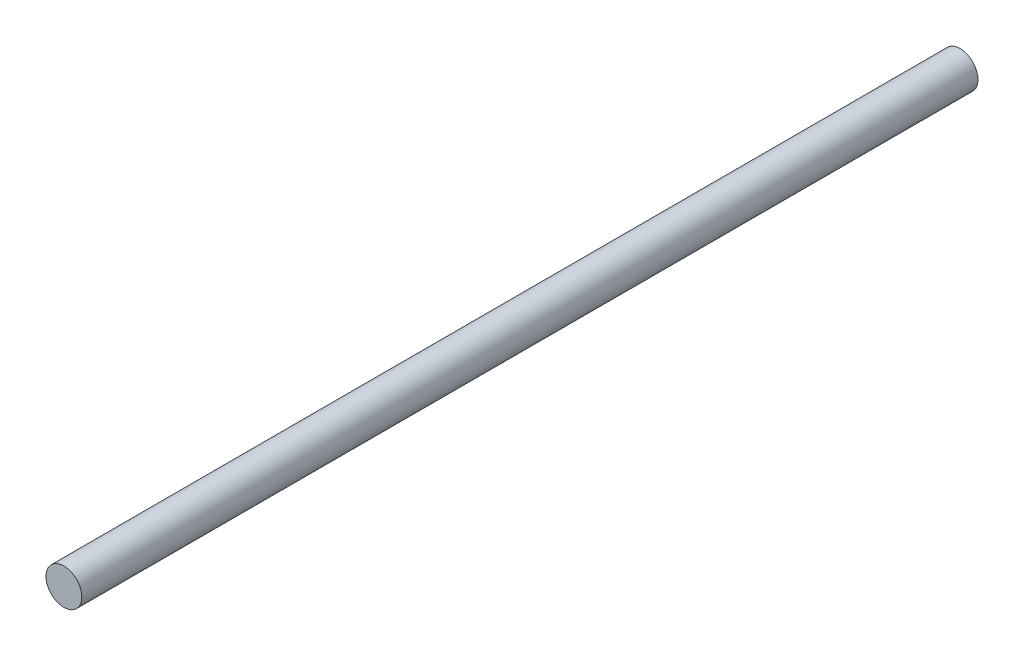
ISO-10303-21;
HEADER;
FILE_DESCRIPTION(('STEP AP214'),'2;1');
FILE_NAME('part.step','',(''),(''),'','','');
FILE_SCHEMA(('AUTOMOTIVE_DESIGN { 1 0 10303 214 1 1 1 1 }'));
ENDSEC;
DATA;
#1=APPLICATION_CONTEXT('core data for automotive mechanical design processes');
#2=APPLICATION_PROTOCOL_DEFINITION('international standard','automotive_design',2000,#1);
#3=PRODUCT_CONTEXT('',#1,'mechanical');
#4=PRODUCT('Part','Part','',(#3));
#5=PRODUCT_RELATED_PRODUCT_CATEGORY('part','',(#4));
#6=PRODUCT_DEFINITION_FORMATION('','',#4);
#7=PRODUCT_DEFINITION_CONTEXT('part definition',#1,'design');
#8=PRODUCT_DEFINITION('design','',#6,#7);
#9=PRODUCT_DEFINITION_SHAPE('','',#8);
#10=(LENGTH_UNIT() NAMED_UNIT(*) SI_UNIT(.MILLI.,.METRE.));
#11=(NAMED_UNIT(*) PLANE_ANGLE_UNIT() SI_UNIT($,.RADIAN.));
#12=(NAMED_UNIT(*) SI_UNIT($,.STERADIAN.) SOLID_ANGLE_UNIT());
#13=UNCERTAINTY_MEASURE_WITH_UNIT(LENGTH_MEASURE(1.E-05),#10,'distance_accuracy_value','');
#14=(GEOMETRIC_REPRESENTATION_CONTEXT(3) GLOBAL_UNCERTAINTY_ASSIGNED_CONTEXT((#13)) GLOBAL_UNIT_ASSIGNED_CONTEXT((#10,
#11,#12)) REPRESENTATION_CONTEXT('',''));
#15=CARTESIAN_POINT('',(0.,0.,0.));
#16=DIRECTION('',(0.,0.,1.));
#17=DIRECTION('',(1.,0.,0.));
#18=AXIS2_PLACEMENT_3D('',#15,#16,#17);
#19=CARTESIAN_POINT('',(0.,0.,100.));
#20=DIRECTION('',(0.,0.,-1.));
#21=DIRECTION('',(-1.,0.,0.));
#22=AXIS2_PLACEMENT_3D('',#19,#20,#21);
#23=CYLINDRICAL_SURFACE('',#22,2.);
#24=CARTESIAN_POINT('',(0.,0.,100.));
#25=DIRECTION('',(0.,0.,1.));
#26=DIRECTION('',(1.,0.,0.));
#27=AXIS2_PLACEMENT_3D('',#24,#25,#26);
#28=CIRCLE('',#27,2.);
#29=CARTESIAN_POINT('',(2.,0.,100.));
#30=VERTEX_POINT('',#29);
#31=EDGE_CURVE('E10',#30,#30,#28,.T.);
#32=ORIENTED_EDGE('',*,*,#31,.F.);
#33=EDGE_LOOP('',(#32));
#34=FACE_BOUND('',#33,.T.);
#35=CARTESIAN_POINT('',(0.,0.,0.));
#36=DIRECTION('',(0.,0.,1.));
#37=DIRECTION('',(1.,0.,0.));
#38=AXIS2_PLACEMENT_3D('',#35,#36,#37);
#39=CIRCLE('',#38,2.);
#40=CARTESIAN_POINT('',(2.,0.,0.));
#41=VERTEX_POINT('',#40);
#42=EDGE_CURVE('E33',#41,#41,#39,.T.);
#43=ORIENTED_EDGE('',*,*,#42,.T.);
#44=EDGE_LOOP('',(#43));
#45=FACE_BOUND('',#44,.T.);
#46=ADVANCED_FACE('F30',(#34,#45),#23,.T.);
#47=CARTESIAN_POINT('',(0.,0.,100.));
#48=DIRECTION('',(0.,0.,1.));
#49=DIRECTION('',(1.,0.,0.));
#50=AXIS2_PLACEMENT_3D('',#47,#48,#49);
#51=PLANE('',#50);
#52=ORIENTED_EDGE('',*,*,#31,.T.);
#53=EDGE_LOOP('',(#52));
#54=FACE_BOUND('',#53,.T.);
#55=ADVANCED_FACE('F45',(#54),#51,.T.);
#56=CARTESIAN_POINT('',(0.,0.,0.));
#57=DIRECTION('',(0.,0.,1.));
#58=DIRECTION('',(1.,0.,0.));
#59=AXIS2_PLACEMENT_3D('',#56,#57,#58);
#60=PLANE('',#59);
#61=ORIENTED_EDGE('',*,*,#42,.F.);
#62=EDGE_LOOP('',(#61));
#63=FACE_BOUND('',#62,.T.);
#64=ADVANCED_FACE('F43',(#63),#60,.F.);
#65=CLOSED_SHELL('',(#46,#55,#64));
#66=MANIFOLD_SOLID_BREP('B2',#65);
#67=ADVANCED_BREP_SHAPE_REPRESENTATION('',(#18,#66),#14);
#68=SHAPE_DEFINITION_REPRESENTATION(#9,#67);
ENDSEC;
END-ISO-10303-21;
